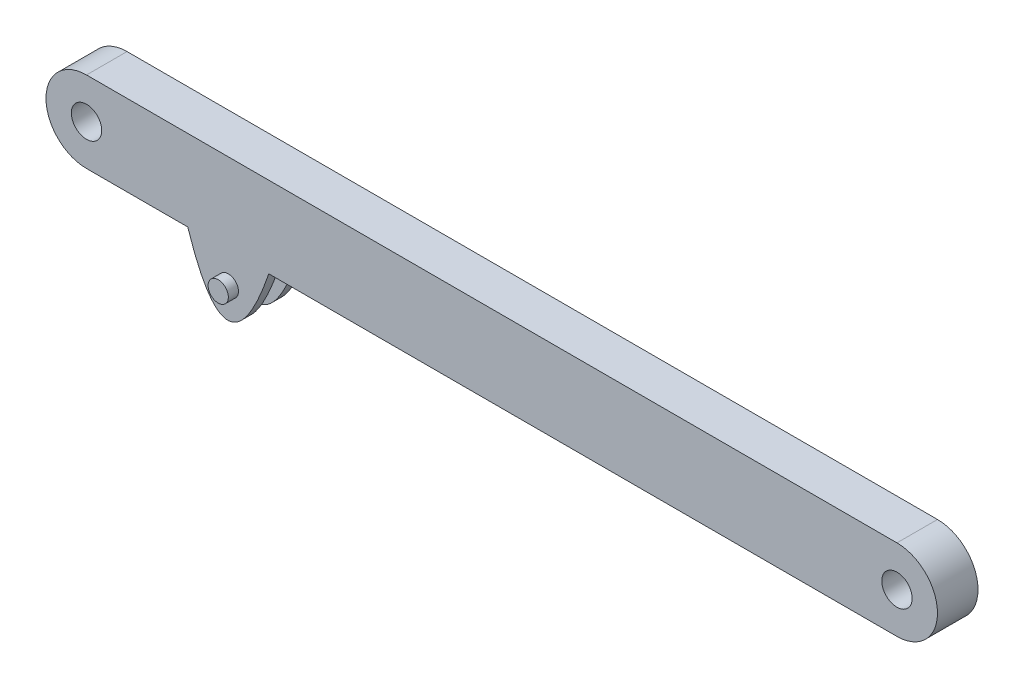
ISO-10303-21;
HEADER;
FILE_DESCRIPTION(('STEP AP214'),'2;1');
FILE_NAME('part.step','',(''),(''),'','','');
FILE_SCHEMA(('AUTOMOTIVE_DESIGN { 1 0 10303 214 1 1 1 1 }'));
ENDSEC;
DATA;
#1=APPLICATION_CONTEXT('core data for automotive mechanical design processes');
#2=APPLICATION_PROTOCOL_DEFINITION('international standard','automotive_design',2000,#1);
#3=PRODUCT_CONTEXT('',#1,'mechanical');
#4=PRODUCT('Part','Part','',(#3));
#5=PRODUCT_RELATED_PRODUCT_CATEGORY('part','',(#4));
#6=PRODUCT_DEFINITION_FORMATION('','',#4);
#7=PRODUCT_DEFINITION_CONTEXT('part definition',#1,'design');
#8=PRODUCT_DEFINITION('design','',#6,#7);
#9=PRODUCT_DEFINITION_SHAPE('','',#8);
#10=(LENGTH_UNIT() NAMED_UNIT(*) SI_UNIT(.MILLI.,.METRE.));
#11=(NAMED_UNIT(*) PLANE_ANGLE_UNIT() SI_UNIT($,.RADIAN.));
#12=(NAMED_UNIT(*) SI_UNIT($,.STERADIAN.) SOLID_ANGLE_UNIT());
#13=UNCERTAINTY_MEASURE_WITH_UNIT(LENGTH_MEASURE(1.E-05),#10,'distance_accuracy_value','');
#14=(GEOMETRIC_REPRESENTATION_CONTEXT(3) GLOBAL_UNCERTAINTY_ASSIGNED_CONTEXT((#13)) GLOBAL_UNIT_ASSIGNED_CONTEXT((#10,
#11,#12)) REPRESENTATION_CONTEXT('',''));
#15=CARTESIAN_POINT('',(0.,0.,0.));
#16=DIRECTION('',(0.,0.,1.));
#17=DIRECTION('',(1.,0.,0.));
#18=AXIS2_PLACEMENT_3D('',#15,#16,#17);
#19=CARTESIAN_POINT('',(-200.,0.,20.));
#20=DIRECTION('',(0.,0.,1.));
#21=DIRECTION('',(1.,0.,0.));
#22=AXIS2_PLACEMENT_3D('',#19,#20,#21);
#23=PLANE('',#22);
#24=CARTESIAN_POINT('',(-200.,0.,20.));
#25=DIRECTION('',(0.,0.,1.));
#26=DIRECTION('',(1.,0.,0.));
#27=AXIS2_PLACEMENT_3D('',#24,#25,#26);
#28=CIRCLE('',#27,20.);
#29=CARTESIAN_POINT('',(-200.,20.,20.));
#30=VERTEX_POINT('',#29);
#31=CARTESIAN_POINT('',(-200.,-20.,20.));
#32=VERTEX_POINT('',#31);
#33=EDGE_CURVE('E237',#30,#32,#28,.T.);
#34=ORIENTED_EDGE('',*,*,#33,.T.);
#35=DIRECTION('',(1.,0.,0.));
#36=VECTOR('',#35,1.);
#37=CARTESIAN_POINT('',(-200.,-20.,20.));
#38=LINE('',#37,#36);
#39=CARTESIAN_POINT('',(-150.037555005749,-20.,20.));
#40=VERTEX_POINT('',#39);
#41=EDGE_CURVE('E270',#32,#40,#38,.T.);
#42=ORIENTED_EDGE('',*,*,#41,.T.);
#43=CARTESIAN_POINT('',(-150.037555005749,-20.,20.));
#44=CARTESIAN_POINT('',(-130.493208153049,-80.0015376287906,20.));
#45=CARTESIAN_POINT('',(-110.037555005749,-20.,20.));
#46=B_SPLINE_CURVE_WITH_KNOTS('',2,(#43,#44,#45),.UNSPECIFIED.,.F.,.F.,(3,3),(0.,1.),.UNSPECIFIED.);
#47=CARTESIAN_POINT('',(-110.037555005749,-20.,20.));
#48=VERTEX_POINT('',#47);
#49=EDGE_CURVE('E48',#40,#48,#46,.T.);
#50=ORIENTED_EDGE('',*,*,#49,.T.);
#51=CARTESIAN_POINT('',(200.,-19.9999999999999,20.));
#52=VERTEX_POINT('',#51);
#53=EDGE_CURVE('E269',#48,#52,#38,.T.);
#54=ORIENTED_EDGE('',*,*,#53,.T.);
#55=CARTESIAN_POINT('',(200.,0.,20.));
#56=DIRECTION('',(0.,0.,1.));
#57=DIRECTION('',(1.,0.,0.));
#58=AXIS2_PLACEMENT_3D('',#55,#56,#57);
#59=CIRCLE('',#58,20.);
#60=CARTESIAN_POINT('',(200.,20.0000000000001,20.));
#61=VERTEX_POINT('',#60);
#62=EDGE_CURVE('E271',#52,#61,#59,.T.);
#63=ORIENTED_EDGE('',*,*,#62,.T.);
#64=DIRECTION('',(-1.,0.,0.));
#65=VECTOR('',#64,1.);
#66=CARTESIAN_POINT('',(-200.,20.,20.));
#67=LINE('',#66,#65);
#68=EDGE_CURVE('E231',#61,#30,#67,.T.);
#69=ORIENTED_EDGE('',*,*,#68,.T.);
#70=EDGE_LOOP('',(#34,#42,#50,#54,#63,#69));
#71=FACE_BOUND('',#70,.T.);
#72=CARTESIAN_POINT('',(200.,0.,20.));
#73=DIRECTION('',(0.,0.,1.));
#74=DIRECTION('',(1.,0.,0.));
#75=AXIS2_PLACEMENT_3D('',#72,#73,#74);
#76=CIRCLE('',#75,7.50000000000001);
#77=CARTESIAN_POINT('',(207.5,0.,20.));
#78=VERTEX_POINT('',#77);
#79=EDGE_CURVE('E228',#78,#78,#76,.T.);
#80=ORIENTED_EDGE('',*,*,#79,.F.);
#81=EDGE_LOOP('',(#80));
#82=FACE_BOUND('',#81,.T.);
#83=CARTESIAN_POINT('',(-200.,0.,20.));
#84=DIRECTION('',(0.,0.,1.));
#85=DIRECTION('',(1.,0.,0.));
#86=AXIS2_PLACEMENT_3D('',#83,#84,#85);
#87=CIRCLE('',#86,7.50000000000001);
#88=CARTESIAN_POINT('',(-192.5,0.,20.));
#89=VERTEX_POINT('',#88);
#90=EDGE_CURVE('E259',#89,#89,#87,.T.);
#91=ORIENTED_EDGE('',*,*,#90,.F.);
#92=EDGE_LOOP('',(#91));
#93=FACE_BOUND('',#92,.T.);
#94=CARTESIAN_POINT('',(-130.,-35.,20.));
#95=DIRECTION('',(0.,0.,1.));
#96=DIRECTION('',(1.,0.,0.));
#97=AXIS2_PLACEMENT_3D('',#94,#95,#96);
#98=CIRCLE('',#97,4.99999999999999);
#99=CARTESIAN_POINT('',(-125.,-35.,20.));
#100=VERTEX_POINT('',#99);
#101=EDGE_CURVE('E123',#100,#100,#98,.F.);
#102=ORIENTED_EDGE('',*,*,#101,.T.);
#103=EDGE_LOOP('',(#102));
#104=FACE_BOUND('',#103,.T.);
#105=ADVANCED_FACE('F33',(#71,#82,#93,#104),#23,.T.);
#106=CARTESIAN_POINT('',(-130.265381579399,-50.0007688143953,15.));
#107=DIRECTION('',(0.,0.,1.));
#108=DIRECTION('',(-1.,0.,0.));
#109=AXIS2_PLACEMENT_3D('',#106,#107,#108);
#110=PLANE('',#109);
#111=CARTESIAN_POINT('',(-150.037555005749,-20.,15.));
#112=CARTESIAN_POINT('',(-130.493208153049,-80.0015376287906,15.));
#113=CARTESIAN_POINT('',(-110.037555005749,-20.,15.));
#114=B_SPLINE_CURVE_WITH_KNOTS('',2,(#111,#112,#113),.UNSPECIFIED.,.F.,.F.,(3,3),(0.,1.),.UNSPECIFIED.);
#115=CARTESIAN_POINT('',(-150.037555005749,-20.,15.));
#116=VERTEX_POINT('',#115);
#117=CARTESIAN_POINT('',(-110.037555005749,-20.,15.));
#118=VERTEX_POINT('',#117);
#119=EDGE_CURVE('E100',#116,#118,#114,.T.);
#120=ORIENTED_EDGE('',*,*,#119,.F.);
#121=DIRECTION('',(-1.,0.,0.));
#122=VECTOR('',#121,1.);
#123=CARTESIAN_POINT('',(-150.037555005749,-20.,15.));
#124=LINE('',#123,#122);
#125=EDGE_CURVE('E109',#118,#116,#124,.T.);
#126=ORIENTED_EDGE('',*,*,#125,.F.);
#127=EDGE_LOOP('',(#120,#126));
#128=FACE_BOUND('',#127,.T.);
#129=CARTESIAN_POINT('',(-130.,-35.,15.));
#130=DIRECTION('',(0.,0.,1.));
#131=DIRECTION('',(1.,0.,0.));
#132=AXIS2_PLACEMENT_3D('',#129,#130,#131);
#133=CIRCLE('',#132,4.99999999999999);
#134=CARTESIAN_POINT('',(-125.,-35.,15.));
#135=VERTEX_POINT('',#134);
#136=EDGE_CURVE('E11',#135,#135,#133,.F.);
#137=ORIENTED_EDGE('',*,*,#136,.F.);
#138=EDGE_LOOP('',(#137));
#139=FACE_BOUND('',#138,.T.);
#140=ADVANCED_FACE('F107',(#128,#139),#110,.F.);
#141=CARTESIAN_POINT('',(-200.,-20.,20.));
#142=DIRECTION('',(0.,1.,0.));
#143=DIRECTION('',(-1.,0.,0.));
#144=AXIS2_PLACEMENT_3D('',#141,#142,#143);
#145=PLANE('',#144);
#146=ORIENTED_EDGE('',*,*,#125,.T.);
#147=DIRECTION('',(0.,0.,1.));
#148=VECTOR('',#147,1.);
#149=CARTESIAN_POINT('',(-150.037555005749,-20.,15.));
#150=LINE('',#149,#148);
#151=EDGE_CURVE('E97',#116,#40,#150,.T.);
#152=ORIENTED_EDGE('',*,*,#151,.T.);
#153=ORIENTED_EDGE('',*,*,#41,.F.);
#154=DIRECTION('',(0.,0.,-1.));
#155=VECTOR('',#154,1.);
#156=CARTESIAN_POINT('',(-200.,-20.,20.));
#157=LINE('',#156,#155);
#158=CARTESIAN_POINT('',(-200.,-20.,0.));
#159=VERTEX_POINT('',#158);
#160=EDGE_CURVE('E41',#32,#159,#157,.T.);
#161=ORIENTED_EDGE('',*,*,#160,.T.);
#162=DIRECTION('',(1.,0.,0.));
#163=VECTOR('',#162,1.);
#164=CARTESIAN_POINT('',(-200.,-20.,0.));
#165=LINE('',#164,#163);
#166=CARTESIAN_POINT('',(-150.037555005749,-20.,0.));
#167=VERTEX_POINT('',#166);
#168=EDGE_CURVE('E221',#159,#167,#165,.T.);
#169=ORIENTED_EDGE('',*,*,#168,.T.);
#170=DIRECTION('',(0.,0.,-1.));
#171=VECTOR('',#170,1.);
#172=CARTESIAN_POINT('',(-150.037555005749,-20.,5.));
#173=LINE('',#172,#171);
#174=CARTESIAN_POINT('',(-150.037555005749,-20.,5.));
#175=VERTEX_POINT('',#174);
#176=EDGE_CURVE('E56',#175,#167,#173,.T.);
#177=ORIENTED_EDGE('',*,*,#176,.F.);
#178=DIRECTION('',(-1.,0.,0.));
#179=VECTOR('',#178,1.);
#180=CARTESIAN_POINT('',(-150.037555005749,-20.,5.));
#181=LINE('',#180,#179);
#182=CARTESIAN_POINT('',(-110.037555005749,-20.,5.));
#183=VERTEX_POINT('',#182);
#184=EDGE_CURVE('E141',#183,#175,#181,.T.);
#185=ORIENTED_EDGE('',*,*,#184,.F.);
#186=DIRECTION('',(0.,0.,-1.));
#187=VECTOR('',#186,1.);
#188=CARTESIAN_POINT('',(-110.037555005749,-20.,5.));
#189=LINE('',#188,#187);
#190=CARTESIAN_POINT('',(-110.037555005749,-20.,0.));
#191=VERTEX_POINT('',#190);
#192=EDGE_CURVE('E257',#183,#191,#189,.T.);
#193=ORIENTED_EDGE('',*,*,#192,.T.);
#194=CARTESIAN_POINT('',(200.,-19.9999999999999,0.));
#195=VERTEX_POINT('',#194);
#196=EDGE_CURVE('E225',#191,#195,#165,.T.);
#197=ORIENTED_EDGE('',*,*,#196,.T.);
#198=DIRECTION('',(0.,0.,-1.));
#199=VECTOR('',#198,1.);
#200=CARTESIAN_POINT('',(200.,-19.9999999999999,20.));
#201=LINE('',#200,#199);
#202=EDGE_CURVE('E243',#52,#195,#201,.T.);
#203=ORIENTED_EDGE('',*,*,#202,.F.);
#204=ORIENTED_EDGE('',*,*,#53,.F.);
#205=DIRECTION('',(0.,0.,1.));
#206=VECTOR('',#205,1.);
#207=CARTESIAN_POINT('',(-110.037555005749,-20.,15.));
#208=LINE('',#207,#206);
#209=EDGE_CURVE('E104',#118,#48,#208,.T.);
#210=ORIENTED_EDGE('',*,*,#209,.F.);
#211=EDGE_LOOP('',(#146,#152,#153,#161,#169,#177,#185,#193,#197,#203,#204,#210));
#212=FACE_BOUND('',#211,.T.);
#213=ADVANCED_FACE('F112',(#212),#145,.F.);
#214=CARTESIAN_POINT('',(-200.,0.,20.));
#215=DIRECTION('',(0.,0.,-1.));
#216=DIRECTION('',(-1.,0.,0.));
#217=AXIS2_PLACEMENT_3D('',#214,#215,#216);
#218=CYLINDRICAL_SURFACE('',#217,20.);
#219=CARTESIAN_POINT('',(-200.,0.,0.));
#220=DIRECTION('',(0.,0.,1.));
#221=DIRECTION('',(1.,0.,0.));
#222=AXIS2_PLACEMENT_3D('',#219,#220,#221);
#223=CIRCLE('',#222,20.);
#224=CARTESIAN_POINT('',(-200.,20.,0.));
#225=VERTEX_POINT('',#224);
#226=EDGE_CURVE('E217',#225,#159,#223,.T.);
#227=ORIENTED_EDGE('',*,*,#226,.T.);
#228=ORIENTED_EDGE('',*,*,#160,.F.);
#229=ORIENTED_EDGE('',*,*,#33,.F.);
#230=DIRECTION('',(0.,0.,-1.));
#231=VECTOR('',#230,1.);
#232=CARTESIAN_POINT('',(-200.,20.,20.));
#233=LINE('',#232,#231);
#234=EDGE_CURVE('E238',#30,#225,#233,.T.);
#235=ORIENTED_EDGE('',*,*,#234,.T.);
#236=EDGE_LOOP('',(#227,#228,#229,#235));
#237=FACE_BOUND('',#236,.T.);
#238=ADVANCED_FACE('F35',(#237),#218,.T.);
#239=CARTESIAN_POINT('',(200.,0.,20.));
#240=DIRECTION('',(0.,0.,-1.));
#241=DIRECTION('',(-1.,0.,0.));
#242=AXIS2_PLACEMENT_3D('',#239,#240,#241);
#243=CYLINDRICAL_SURFACE('',#242,20.);
#244=CARTESIAN_POINT('',(200.,0.,0.));
#245=DIRECTION('',(0.,0.,1.));
#246=DIRECTION('',(1.,0.,0.));
#247=AXIS2_PLACEMENT_3D('',#244,#245,#246);
#248=CIRCLE('',#247,20.);
#249=CARTESIAN_POINT('',(200.,20.0000000000001,0.));
#250=VERTEX_POINT('',#249);
#251=EDGE_CURVE('E234',#195,#250,#248,.T.);
#252=ORIENTED_EDGE('',*,*,#251,.T.);
#253=DIRECTION('',(0.,0.,-1.));
#254=VECTOR('',#253,1.);
#255=CARTESIAN_POINT('',(200.,20.0000000000001,20.));
#256=LINE('',#255,#254);
#257=EDGE_CURVE('E240',#61,#250,#256,.T.);
#258=ORIENTED_EDGE('',*,*,#257,.F.);
#259=ORIENTED_EDGE('',*,*,#62,.F.);
#260=ORIENTED_EDGE('',*,*,#202,.T.);
#261=EDGE_LOOP('',(#252,#258,#259,#260));
#262=FACE_BOUND('',#261,.T.);
#263=ADVANCED_FACE('F171',(#262),#243,.T.);
#264=CARTESIAN_POINT('',(-200.,20.,20.));
#265=DIRECTION('',(0.,-1.,0.));
#266=DIRECTION('',(1.,0.,0.));
#267=AXIS2_PLACEMENT_3D('',#264,#265,#266);
#268=PLANE('',#267);
#269=DIRECTION('',(-1.,0.,0.));
#270=VECTOR('',#269,1.);
#271=CARTESIAN_POINT('',(-200.,20.,0.));
#272=LINE('',#271,#270);
#273=EDGE_CURVE('E219',#250,#225,#272,.T.);
#274=ORIENTED_EDGE('',*,*,#273,.T.);
#275=ORIENTED_EDGE('',*,*,#234,.F.);
#276=ORIENTED_EDGE('',*,*,#68,.F.);
#277=ORIENTED_EDGE('',*,*,#257,.T.);
#278=EDGE_LOOP('',(#274,#275,#276,#277));
#279=FACE_BOUND('',#278,.T.);
#280=ADVANCED_FACE('F167',(#279),#268,.F.);
#281=CARTESIAN_POINT('',(-200.,0.,0.));
#282=DIRECTION('',(0.,0.,1.));
#283=DIRECTION('',(1.,0.,0.));
#284=AXIS2_PLACEMENT_3D('',#281,#282,#283);
#285=PLANE('',#284);
#286=CARTESIAN_POINT('',(-130.,-35.,0.));
#287=DIRECTION('',(0.,0.,1.));
#288=DIRECTION('',(1.,0.,0.));
#289=AXIS2_PLACEMENT_3D('',#286,#287,#288);
#290=CIRCLE('',#289,4.99999999999999);
#291=CARTESIAN_POINT('',(-125.,-35.,0.));
#292=VERTEX_POINT('',#291);
#293=EDGE_CURVE('E131',#292,#292,#290,.T.);
#294=ORIENTED_EDGE('',*,*,#293,.T.);
#295=EDGE_LOOP('',(#294));
#296=FACE_BOUND('',#295,.T.);
#297=CARTESIAN_POINT('',(-200.,0.,0.));
#298=DIRECTION('',(0.,0.,1.));
#299=DIRECTION('',(1.,0.,0.));
#300=AXIS2_PLACEMENT_3D('',#297,#298,#299);
#301=CIRCLE('',#300,7.50000000000001);
#302=CARTESIAN_POINT('',(-192.5,0.,0.));
#303=VERTEX_POINT('',#302);
#304=EDGE_CURVE('E209',#303,#303,#301,.T.);
#305=ORIENTED_EDGE('',*,*,#304,.T.);
#306=EDGE_LOOP('',(#305));
#307=FACE_BOUND('',#306,.T.);
#308=CARTESIAN_POINT('',(200.,0.,0.));
#309=DIRECTION('',(0.,0.,1.));
#310=DIRECTION('',(1.,0.,0.));
#311=AXIS2_PLACEMENT_3D('',#308,#309,#310);
#312=CIRCLE('',#311,7.50000000000001);
#313=CARTESIAN_POINT('',(207.5,0.,0.));
#314=VERTEX_POINT('',#313);
#315=EDGE_CURVE('E213',#314,#314,#312,.T.);
#316=ORIENTED_EDGE('',*,*,#315,.T.);
#317=EDGE_LOOP('',(#316));
#318=FACE_BOUND('',#317,.T.);
#319=ORIENTED_EDGE('',*,*,#226,.F.);
#320=ORIENTED_EDGE('',*,*,#273,.F.);
#321=ORIENTED_EDGE('',*,*,#251,.F.);
#322=ORIENTED_EDGE('',*,*,#196,.F.);
#323=CARTESIAN_POINT('',(-150.037555005749,-20.,0.));
#324=CARTESIAN_POINT('',(-130.493208153049,-80.0015376287906,0.));
#325=CARTESIAN_POINT('',(-110.037555005749,-20.,0.));
#326=B_SPLINE_CURVE_WITH_KNOTS('',2,(#323,#324,#325),.UNSPECIFIED.,.F.,.F.,(3,3),(0.,1.),.UNSPECIFIED.);
#327=EDGE_CURVE('E134',#167,#191,#326,.T.);
#328=ORIENTED_EDGE('',*,*,#327,.F.);
#329=ORIENTED_EDGE('',*,*,#168,.F.);
#330=EDGE_LOOP('',(#319,#320,#321,#322,#328,#329));
#331=FACE_BOUND('',#330,.T.);
#332=ADVANCED_FACE('F161',(#296,#307,#318,#331),#285,.F.);
#333=CARTESIAN_POINT('',(200.,0.,0.));
#334=DIRECTION('',(0.,0.,1.));
#335=DIRECTION('',(1.,0.,0.));
#336=AXIS2_PLACEMENT_3D('',#333,#334,#335);
#337=CYLINDRICAL_SURFACE('',#336,7.50000000000001);
#338=ORIENTED_EDGE('',*,*,#315,.F.);
#339=EDGE_LOOP('',(#338));
#340=FACE_BOUND('',#339,.T.);
#341=ORIENTED_EDGE('',*,*,#79,.T.);
#342=EDGE_LOOP('',(#341));
#343=FACE_BOUND('',#342,.T.);
#344=ADVANCED_FACE('F157',(#340,#343),#337,.F.);
#345=CARTESIAN_POINT('',(-200.,0.,0.));
#346=DIRECTION('',(0.,0.,1.));
#347=DIRECTION('',(1.,0.,0.));
#348=AXIS2_PLACEMENT_3D('',#345,#346,#347);
#349=CYLINDRICAL_SURFACE('',#348,7.50000000000001);
#350=ORIENTED_EDGE('',*,*,#304,.F.);
#351=EDGE_LOOP('',(#350));
#352=FACE_BOUND('',#351,.T.);
#353=ORIENTED_EDGE('',*,*,#90,.T.);
#354=EDGE_LOOP('',(#353));
#355=FACE_BOUND('',#354,.T.);
#356=ADVANCED_FACE('F152',(#352,#355),#349,.F.);
#357=CARTESIAN_POINT('',(-150.037555005749,-20.,5.));
#358=CARTESIAN_POINT('',(-130.493208153049,-80.0015376287906,5.));
#359=CARTESIAN_POINT('',(-110.037555005749,-20.,5.));
#360=B_SPLINE_CURVE_WITH_KNOTS('',2,(#357,#358,#359),.UNSPECIFIED.,.F.,.F.,(3,3),(0.,1.),.UNSPECIFIED.);
#361=DIRECTION('',(0.,0.,-1.));
#362=VECTOR('',#361,1.);
#363=SURFACE_OF_LINEAR_EXTRUSION('',#360,#362);
#364=ORIENTED_EDGE('',*,*,#327,.T.);
#365=ORIENTED_EDGE('',*,*,#192,.F.);
#366=EDGE_CURVE('E135',#175,#183,#360,.T.);
#367=ORIENTED_EDGE('',*,*,#366,.F.);
#368=ORIENTED_EDGE('',*,*,#176,.T.);
#369=EDGE_LOOP('',(#364,#365,#367,#368));
#370=FACE_BOUND('',#369,.T.);
#371=ADVANCED_FACE('F147',(#370),#363,.F.);
#372=CARTESIAN_POINT('',(-130.265381579399,-50.0007688143953,5.));
#373=DIRECTION('',(0.,0.,-1.));
#374=DIRECTION('',(-1.,0.,0.));
#375=AXIS2_PLACEMENT_3D('',#372,#373,#374);
#376=PLANE('',#375);
#377=CARTESIAN_POINT('',(-130.,-35.,5.));
#378=DIRECTION('',(0.,0.,-1.));
#379=DIRECTION('',(-1.,0.,0.));
#380=AXIS2_PLACEMENT_3D('',#377,#378,#379);
#381=CIRCLE('',#380,4.99999999999999);
#382=CARTESIAN_POINT('',(-135.,-35.,5.));
#383=VERTEX_POINT('',#382);
#384=EDGE_CURVE('E130',#383,#383,#381,.T.);
#385=ORIENTED_EDGE('',*,*,#384,.T.);
#386=EDGE_LOOP('',(#385));
#387=FACE_BOUND('',#386,.T.);
#388=ORIENTED_EDGE('',*,*,#366,.T.);
#389=ORIENTED_EDGE('',*,*,#184,.T.);
#390=EDGE_LOOP('',(#388,#389));
#391=FACE_BOUND('',#390,.T.);
#392=ADVANCED_FACE('F151',(#387,#391),#376,.F.);
#393=CARTESIAN_POINT('',(-130.,-35.,-5.));
#394=DIRECTION('',(0.,0.,1.));
#395=DIRECTION('',(1.,0.,0.));
#396=AXIS2_PLACEMENT_3D('',#393,#394,#395);
#397=CYLINDRICAL_SURFACE('',#396,4.99999999999999);
#398=ORIENTED_EDGE('',*,*,#384,.F.);
#399=EDGE_LOOP('',(#398));
#400=FACE_BOUND('',#399,.T.);
#401=ORIENTED_EDGE('',*,*,#136,.T.);
#402=EDGE_LOOP('',(#401));
#403=FACE_BOUND('',#402,.T.);
#404=ADVANCED_FACE('F196',(#400,#403),#397,.T.);
#405=CARTESIAN_POINT('',(-130.,-35.,-5.));
#406=DIRECTION('',(0.,0.,1.));
#407=DIRECTION('',(1.,0.,0.));
#408=AXIS2_PLACEMENT_3D('',#405,#406,#407);
#409=CIRCLE('',#408,4.99999999999999);
#410=CARTESIAN_POINT('',(-125.,-35.,-5.));
#411=VERTEX_POINT('',#410);
#412=EDGE_CURVE('E103',#411,#411,#409,.T.);
#413=ORIENTED_EDGE('',*,*,#412,.T.);
#414=EDGE_LOOP('',(#413));
#415=FACE_BOUND('',#414,.T.);
#416=ORIENTED_EDGE('',*,*,#293,.F.);
#417=EDGE_LOOP('',(#416));
#418=FACE_BOUND('',#417,.T.);
#419=ADVANCED_FACE('F193',(#415,#418),#397,.T.);
#420=CARTESIAN_POINT('',(-130.,-35.,-5.));
#421=DIRECTION('',(0.,0.,1.));
#422=DIRECTION('',(1.,0.,0.));
#423=AXIS2_PLACEMENT_3D('',#420,#421,#422);
#424=PLANE('',#423);
#425=ORIENTED_EDGE('',*,*,#412,.F.);
#426=EDGE_LOOP('',(#425));
#427=FACE_BOUND('',#426,.T.);
#428=ADVANCED_FACE('F191',(#427),#424,.F.);
#429=DIRECTION('',(0.,0.,1.));
#430=VECTOR('',#429,1.);
#431=SURFACE_OF_LINEAR_EXTRUSION('',#114,#430);
#432=ORIENTED_EDGE('',*,*,#49,.F.);
#433=ORIENTED_EDGE('',*,*,#151,.F.);
#434=ORIENTED_EDGE('',*,*,#119,.T.);
#435=ORIENTED_EDGE('',*,*,#209,.T.);
#436=EDGE_LOOP('',(#432,#433,#434,#435));
#437=FACE_BOUND('',#436,.T.);
#438=ADVANCED_FACE('F99',(#437),#431,.T.);
#439=CARTESIAN_POINT('',(-130.,-35.,25.));
#440=DIRECTION('',(0.,0.,-1.));
#441=DIRECTION('',(-1.,0.,0.));
#442=AXIS2_PLACEMENT_3D('',#439,#440,#441);
#443=CYLINDRICAL_SURFACE('',#442,4.99999999999999);
#444=ORIENTED_EDGE('',*,*,#101,.F.);
#445=EDGE_LOOP('',(#444));
#446=FACE_BOUND('',#445,.T.);
#447=CARTESIAN_POINT('',(-130.,-35.,25.));
#448=DIRECTION('',(0.,0.,1.));
#449=DIRECTION('',(1.,0.,0.));
#450=AXIS2_PLACEMENT_3D('',#447,#448,#449);
#451=CIRCLE('',#450,4.99999999999999);
#452=CARTESIAN_POINT('',(-125.,-35.,25.));
#453=VERTEX_POINT('',#452);
#454=EDGE_CURVE('E291',#453,#453,#451,.T.);
#455=ORIENTED_EDGE('',*,*,#454,.F.);
#456=EDGE_LOOP('',(#455));
#457=FACE_BOUND('',#456,.T.);
#458=ADVANCED_FACE('F187',(#446,#457),#443,.T.);
#459=CARTESIAN_POINT('',(-130.,-35.,25.));
#460=DIRECTION('',(0.,0.,-1.));
#461=DIRECTION('',(1.,0.,0.));
#462=AXIS2_PLACEMENT_3D('',#459,#460,#461);
#463=PLANE('',#462);
#464=ORIENTED_EDGE('',*,*,#454,.T.);
#465=EDGE_LOOP('',(#464));
#466=FACE_BOUND('',#465,.T.);
#467=ADVANCED_FACE('F296',(#466),#463,.F.);
#468=CLOSED_SHELL('',(#105,#140,#213,#238,#263,#280,#332,#344,#356,#371,#392,#404,#419,#428,
#438,#458,#467));
#469=MANIFOLD_SOLID_BREP('B2',#468);
#470=ADVANCED_BREP_SHAPE_REPRESENTATION('',(#18,#469),#14);
#471=SHAPE_DEFINITION_REPRESENTATION(#9,#470);
ENDSEC;
END-ISO-10303-21;
